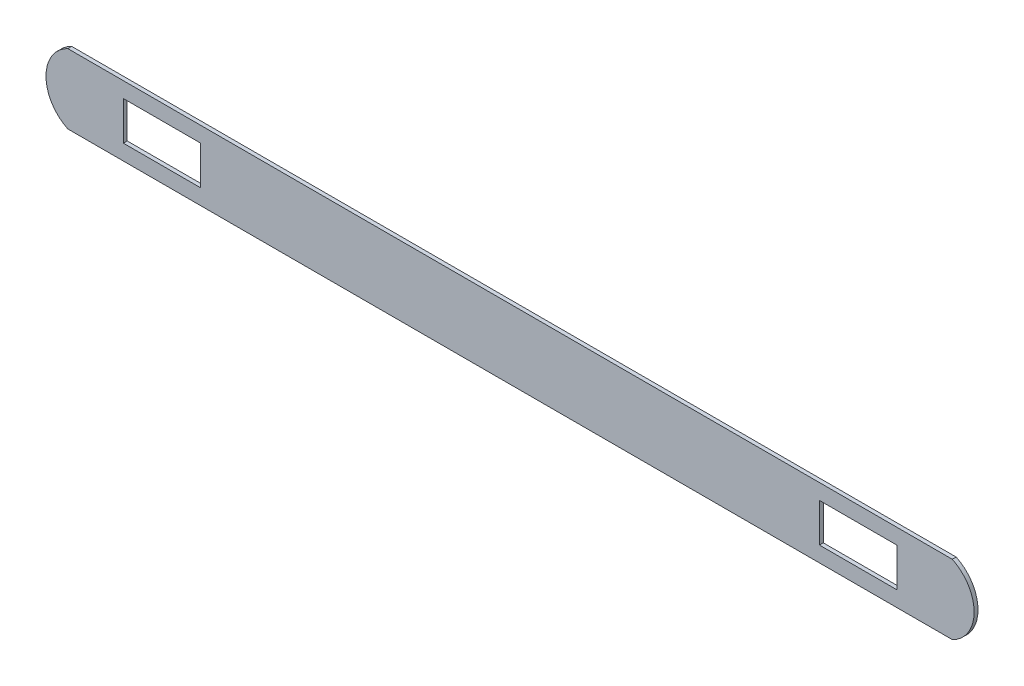
ISO-10303-21;
HEADER;
FILE_DESCRIPTION(('STEP AP214'),'2;1');
FILE_NAME('part.step','',(''),(''),'','','');
FILE_SCHEMA(('AUTOMOTIVE_DESIGN { 1 0 10303 214 1 1 1 1 }'));
ENDSEC;
DATA;
#1=APPLICATION_CONTEXT('core data for automotive mechanical design processes');
#2=APPLICATION_PROTOCOL_DEFINITION('international standard','automotive_design',2000,#1);
#3=PRODUCT_CONTEXT('',#1,'mechanical');
#4=PRODUCT('Part','Part','',(#3));
#5=PRODUCT_RELATED_PRODUCT_CATEGORY('part','',(#4));
#6=PRODUCT_DEFINITION_FORMATION('','',#4);
#7=PRODUCT_DEFINITION_CONTEXT('part definition',#1,'design');
#8=PRODUCT_DEFINITION('design','',#6,#7);
#9=PRODUCT_DEFINITION_SHAPE('','',#8);
#10=(LENGTH_UNIT() NAMED_UNIT(*) SI_UNIT(.MILLI.,.METRE.));
#11=(NAMED_UNIT(*) PLANE_ANGLE_UNIT() SI_UNIT($,.RADIAN.));
#12=(NAMED_UNIT(*) SI_UNIT($,.STERADIAN.) SOLID_ANGLE_UNIT());
#13=UNCERTAINTY_MEASURE_WITH_UNIT(LENGTH_MEASURE(1.E-05),#10,'distance_accuracy_value','');
#14=(GEOMETRIC_REPRESENTATION_CONTEXT(3) GLOBAL_UNCERTAINTY_ASSIGNED_CONTEXT((#13)) GLOBAL_UNIT_ASSIGNED_CONTEXT((#10,
#11,#12)) REPRESENTATION_CONTEXT('',''));
#15=CARTESIAN_POINT('',(0.,0.,0.));
#16=DIRECTION('',(0.,0.,1.));
#17=DIRECTION('',(1.,0.,0.));
#18=AXIS2_PLACEMENT_3D('',#15,#16,#17);
#19=CARTESIAN_POINT('',(0.,45.,0.));
#20=DIRECTION('',(0.,-1.,0.));
#21=DIRECTION('',(0.,0.,-1.));
#22=AXIS2_PLACEMENT_3D('',#19,#20,#21);
#23=PLANE('',#22);
#24=DIRECTION('',(0.,0.,-1.));
#25=VECTOR('',#24,1.);
#26=CARTESIAN_POINT('',(-524.528236675635,45.,80.));
#27=LINE('',#26,#25);
#28=CARTESIAN_POINT('',(-524.528236675635,45.,5.));
#29=VERTEX_POINT('',#28);
#30=CARTESIAN_POINT('',(-524.528236675635,45.,0.));
#31=VERTEX_POINT('',#30);
#32=EDGE_CURVE('E219',#29,#31,#27,.T.);
#33=ORIENTED_EDGE('',*,*,#32,.F.);
#34=DIRECTION('',(1.,0.,0.));
#35=VECTOR('',#34,1.);
#36=CARTESIAN_POINT('',(597.266258042068,45.,5.));
#37=LINE('',#36,#35);
#38=CARTESIAN_POINT('',(619.060752759772,45.,5.));
#39=VERTEX_POINT('',#38);
#40=EDGE_CURVE('E11',#29,#39,#37,.T.);
#41=ORIENTED_EDGE('',*,*,#40,.T.);
#42=DIRECTION('',(0.,0.,-1.));
#43=VECTOR('',#42,1.);
#44=CARTESIAN_POINT('',(619.060752759772,45.,80.));
#45=LINE('',#44,#43);
#46=CARTESIAN_POINT('',(619.060752759772,45.,0.));
#47=VERTEX_POINT('',#46);
#48=EDGE_CURVE('E49',#47,#39,#45,.F.);
#49=ORIENTED_EDGE('',*,*,#48,.F.);
#50=DIRECTION('',(1.,0.,0.));
#51=VECTOR('',#50,1.);
#52=CARTESIAN_POINT('',(-502.733741957931,45.,0.));
#53=LINE('',#52,#51);
#54=EDGE_CURVE('E37',#31,#47,#53,.T.);
#55=ORIENTED_EDGE('',*,*,#54,.F.);
#56=EDGE_LOOP('',(#33,#41,#49,#55));
#57=FACE_BOUND('',#56,.T.);
#58=ADVANCED_FACE('F34',(#57),#23,.F.);
#59=CARTESIAN_POINT('',(0.,-45.,0.));
#60=DIRECTION('',(0.,1.,0.));
#61=DIRECTION('',(0.,0.,1.));
#62=AXIS2_PLACEMENT_3D('',#59,#60,#61);
#63=PLANE('',#62);
#64=DIRECTION('',(0.,0.,-1.));
#65=VECTOR('',#64,1.);
#66=CARTESIAN_POINT('',(619.060752759772,-45.,80.));
#67=LINE('',#66,#65);
#68=CARTESIAN_POINT('',(619.060752759772,-45.,5.));
#69=VERTEX_POINT('',#68);
#70=CARTESIAN_POINT('',(619.060752759772,-45.,0.));
#71=VERTEX_POINT('',#70);
#72=EDGE_CURVE('E207',#69,#71,#67,.T.);
#73=ORIENTED_EDGE('',*,*,#72,.F.);
#74=DIRECTION('',(-1.,0.,0.));
#75=VECTOR('',#74,1.);
#76=CARTESIAN_POINT('',(597.266258042068,-45.,5.));
#77=LINE('',#76,#75);
#78=CARTESIAN_POINT('',(-524.528236675635,-45.,5.));
#79=VERTEX_POINT('',#78);
#80=EDGE_CURVE('E208',#69,#79,#77,.T.);
#81=ORIENTED_EDGE('',*,*,#80,.T.);
#82=DIRECTION('',(0.,0.,-1.));
#83=VECTOR('',#82,1.);
#84=CARTESIAN_POINT('',(-524.528236675635,-45.,80.));
#85=LINE('',#84,#83);
#86=CARTESIAN_POINT('',(-524.528236675635,-45.,0.));
#87=VERTEX_POINT('',#86);
#88=EDGE_CURVE('E214',#87,#79,#85,.F.);
#89=ORIENTED_EDGE('',*,*,#88,.F.);
#90=DIRECTION('',(-1.,0.,0.));
#91=VECTOR('',#90,1.);
#92=CARTESIAN_POINT('',(-502.733741957931,-45.,0.));
#93=LINE('',#92,#91);
#94=EDGE_CURVE('E211',#71,#87,#93,.T.);
#95=ORIENTED_EDGE('',*,*,#94,.F.);
#96=EDGE_LOOP('',(#73,#81,#89,#95));
#97=FACE_BOUND('',#96,.T.);
#98=ADVANCED_FACE('F231',(#97),#63,.F.);
#99=CARTESIAN_POINT('',(-502.733741957931,0.,0.));
#100=DIRECTION('',(0.,0.,1.));
#101=DIRECTION('',(1.,0.,0.));
#102=AXIS2_PLACEMENT_3D('',#99,#100,#101);
#103=PLANE('',#102);
#104=DIRECTION('',(-1.,0.,0.));
#105=VECTOR('',#104,1.);
#106=CARTESIAN_POINT('',(-502.733741957931,25.,0.));
#107=LINE('',#106,#105);
#108=CARTESIAN_POINT('',(-352.733741957931,25.,0.));
#109=VERTEX_POINT('',#108);
#110=CARTESIAN_POINT('',(-452.733741957932,25.,0.));
#111=VERTEX_POINT('',#110);
#112=EDGE_CURVE('E193',#109,#111,#107,.T.);
#113=ORIENTED_EDGE('',*,*,#112,.T.);
#114=DIRECTION('',(0.,-1.,0.));
#115=VECTOR('',#114,1.);
#116=CARTESIAN_POINT('',(-452.733741957932,0.,0.));
#117=LINE('',#116,#115);
#118=CARTESIAN_POINT('',(-452.733741957932,-25.,0.));
#119=VERTEX_POINT('',#118);
#120=EDGE_CURVE('E196',#111,#119,#117,.T.);
#121=ORIENTED_EDGE('',*,*,#120,.T.);
#122=DIRECTION('',(1.,0.,0.));
#123=VECTOR('',#122,1.);
#124=CARTESIAN_POINT('',(-502.733741957931,-25.,0.));
#125=LINE('',#124,#123);
#126=CARTESIAN_POINT('',(-352.733741957931,-25.,0.));
#127=VERTEX_POINT('',#126);
#128=EDGE_CURVE('E190',#119,#127,#125,.T.);
#129=ORIENTED_EDGE('',*,*,#128,.T.);
#130=DIRECTION('',(0.,1.,0.));
#131=VECTOR('',#130,1.);
#132=CARTESIAN_POINT('',(-352.733741957931,0.,0.));
#133=LINE('',#132,#131);
#134=EDGE_CURVE('E131',#127,#109,#133,.T.);
#135=ORIENTED_EDGE('',*,*,#134,.T.);
#136=EDGE_LOOP('',(#113,#121,#129,#135));
#137=FACE_BOUND('',#136,.T.);
#138=DIRECTION('',(-1.,0.,0.));
#139=VECTOR('',#138,1.);
#140=CARTESIAN_POINT('',(-502.733741957931,25.0000000000004,0.));
#141=LINE('',#140,#139);
#142=CARTESIAN_POINT('',(547.266258042068,25.,0.));
#143=VERTEX_POINT('',#142);
#144=CARTESIAN_POINT('',(447.266258042068,25.,0.));
#145=VERTEX_POINT('',#144);
#146=EDGE_CURVE('E184',#143,#145,#141,.T.);
#147=ORIENTED_EDGE('',*,*,#146,.T.);
#148=DIRECTION('',(0.,-1.,0.));
#149=VECTOR('',#148,1.);
#150=CARTESIAN_POINT('',(447.266258042068,0.,0.));
#151=LINE('',#150,#149);
#152=CARTESIAN_POINT('',(447.266258042068,-25.,0.));
#153=VERTEX_POINT('',#152);
#154=EDGE_CURVE('E187',#145,#153,#151,.T.);
#155=ORIENTED_EDGE('',*,*,#154,.T.);
#156=DIRECTION('',(1.,0.,0.));
#157=VECTOR('',#156,1.);
#158=CARTESIAN_POINT('',(-502.733741957931,-25.,0.));
#159=LINE('',#158,#157);
#160=CARTESIAN_POINT('',(547.266258042068,-25.,0.));
#161=VERTEX_POINT('',#160);
#162=EDGE_CURVE('E156',#153,#161,#159,.T.);
#163=ORIENTED_EDGE('',*,*,#162,.T.);
#164=DIRECTION('',(0.,1.,0.));
#165=VECTOR('',#164,1.);
#166=CARTESIAN_POINT('',(547.266258042068,0.,0.));
#167=LINE('',#166,#165);
#168=EDGE_CURVE('E181',#161,#143,#167,.T.);
#169=ORIENTED_EDGE('',*,*,#168,.T.);
#170=EDGE_LOOP('',(#147,#155,#163,#169));
#171=FACE_BOUND('',#170,.T.);
#172=CARTESIAN_POINT('',(-502.733741957931,0.,0.));
#173=DIRECTION('',(0.,0.,1.));
#174=DIRECTION('',(1.,0.,0.));
#175=AXIS2_PLACEMENT_3D('',#172,#173,#174);
#176=CIRCLE('',#175,50.);
#177=EDGE_CURVE('E203',#31,#87,#176,.T.);
#178=ORIENTED_EDGE('',*,*,#177,.F.);
#179=ORIENTED_EDGE('',*,*,#54,.T.);
#180=CARTESIAN_POINT('',(597.266258042068,0.,0.));
#181=DIRECTION('',(0.,0.,1.));
#182=DIRECTION('',(1.,0.,0.));
#183=AXIS2_PLACEMENT_3D('',#180,#181,#182);
#184=CIRCLE('',#183,50.);
#185=EDGE_CURVE('E199',#71,#47,#184,.T.);
#186=ORIENTED_EDGE('',*,*,#185,.F.);
#187=ORIENTED_EDGE('',*,*,#94,.T.);
#188=EDGE_LOOP('',(#178,#179,#186,#187));
#189=FACE_BOUND('',#188,.T.);
#190=ADVANCED_FACE('F226',(#137,#171,#189),#103,.F.);
#191=CARTESIAN_POINT('',(-502.733741957931,0.,80.));
#192=DIRECTION('',(0.,0.,-1.));
#193=DIRECTION('',(-1.,0.,0.));
#194=AXIS2_PLACEMENT_3D('',#191,#192,#193);
#195=CYLINDRICAL_SURFACE('',#194,50.);
#196=CARTESIAN_POINT('',(-502.733741957931,0.,5.));
#197=DIRECTION('',(0.,0.,1.));
#198=DIRECTION('',(1.,0.,0.));
#199=AXIS2_PLACEMENT_3D('',#196,#197,#198);
#200=CIRCLE('',#199,50.);
#201=EDGE_CURVE('E205',#29,#79,#200,.T.);
#202=ORIENTED_EDGE('',*,*,#201,.F.);
#203=ORIENTED_EDGE('',*,*,#32,.T.);
#204=ORIENTED_EDGE('',*,*,#177,.T.);
#205=ORIENTED_EDGE('',*,*,#88,.T.);
#206=EDGE_LOOP('',(#202,#203,#204,#205));
#207=FACE_BOUND('',#206,.T.);
#208=ADVANCED_FACE('F233',(#207),#195,.T.);
#209=CARTESIAN_POINT('',(597.266258042068,0.,80.));
#210=DIRECTION('',(0.,0.,-1.));
#211=DIRECTION('',(-1.,0.,0.));
#212=AXIS2_PLACEMENT_3D('',#209,#210,#211);
#213=CYLINDRICAL_SURFACE('',#212,50.);
#214=ORIENTED_EDGE('',*,*,#185,.T.);
#215=ORIENTED_EDGE('',*,*,#48,.T.);
#216=CARTESIAN_POINT('',(597.266258042068,0.,5.));
#217=DIRECTION('',(0.,0.,1.));
#218=DIRECTION('',(1.,0.,0.));
#219=AXIS2_PLACEMENT_3D('',#216,#217,#218);
#220=CIRCLE('',#219,50.);
#221=EDGE_CURVE('E201',#69,#39,#220,.T.);
#222=ORIENTED_EDGE('',*,*,#221,.F.);
#223=ORIENTED_EDGE('',*,*,#72,.T.);
#224=EDGE_LOOP('',(#214,#215,#222,#223));
#225=FACE_BOUND('',#224,.T.);
#226=ADVANCED_FACE('F228',(#225),#213,.T.);
#227=CARTESIAN_POINT('',(597.266258042068,-45.,5.));
#228=DIRECTION('',(0.,0.,1.));
#229=DIRECTION('',(1.,0.,0.));
#230=AXIS2_PLACEMENT_3D('',#227,#228,#229);
#231=PLANE('',#230);
#232=ORIENTED_EDGE('',*,*,#40,.F.);
#233=ORIENTED_EDGE('',*,*,#201,.T.);
#234=ORIENTED_EDGE('',*,*,#80,.F.);
#235=ORIENTED_EDGE('',*,*,#221,.T.);
#236=EDGE_LOOP('',(#232,#233,#234,#235));
#237=FACE_BOUND('',#236,.T.);
#238=DIRECTION('',(0.,-1.,0.));
#239=VECTOR('',#238,1.);
#240=CARTESIAN_POINT('',(-452.733741957932,25.,5.));
#241=LINE('',#240,#239);
#242=CARTESIAN_POINT('',(-452.733741957932,25.,5.));
#243=VERTEX_POINT('',#242);
#244=CARTESIAN_POINT('',(-452.733741957931,-25.,5.));
#245=VERTEX_POINT('',#244);
#246=EDGE_CURVE('E144',#243,#245,#241,.T.);
#247=ORIENTED_EDGE('',*,*,#246,.F.);
#248=DIRECTION('',(-1.,0.,0.));
#249=VECTOR('',#248,1.);
#250=CARTESIAN_POINT('',(-452.733741957932,25.,5.));
#251=LINE('',#250,#249);
#252=CARTESIAN_POINT('',(-352.733741957931,25.,5.));
#253=VERTEX_POINT('',#252);
#254=EDGE_CURVE('E149',#253,#243,#251,.T.);
#255=ORIENTED_EDGE('',*,*,#254,.F.);
#256=DIRECTION('',(0.,1.,0.));
#257=VECTOR('',#256,1.);
#258=CARTESIAN_POINT('',(-352.733741957931,25.,5.));
#259=LINE('',#258,#257);
#260=CARTESIAN_POINT('',(-352.733741957931,-25.,5.));
#261=VERTEX_POINT('',#260);
#262=EDGE_CURVE('E128',#261,#253,#259,.T.);
#263=ORIENTED_EDGE('',*,*,#262,.F.);
#264=DIRECTION('',(1.,0.,0.));
#265=VECTOR('',#264,1.);
#266=CARTESIAN_POINT('',(-452.733741957932,-25.,5.));
#267=LINE('',#266,#265);
#268=EDGE_CURVE('E139',#245,#261,#267,.T.);
#269=ORIENTED_EDGE('',*,*,#268,.F.);
#270=EDGE_LOOP('',(#247,#255,#263,#269));
#271=FACE_BOUND('',#270,.T.);
#272=DIRECTION('',(0.,-1.,0.));
#273=VECTOR('',#272,1.);
#274=CARTESIAN_POINT('',(447.266258042068,25.,5.));
#275=LINE('',#274,#273);
#276=CARTESIAN_POINT('',(447.266258042068,25.,5.));
#277=VERTEX_POINT('',#276);
#278=CARTESIAN_POINT('',(447.266258042068,-25.,5.));
#279=VERTEX_POINT('',#278);
#280=EDGE_CURVE('E159',#277,#279,#275,.T.);
#281=ORIENTED_EDGE('',*,*,#280,.F.);
#282=DIRECTION('',(-1.,0.,0.));
#283=VECTOR('',#282,1.);
#284=CARTESIAN_POINT('',(447.266258042068,25.,5.));
#285=LINE('',#284,#283);
#286=CARTESIAN_POINT('',(547.266258042068,25.,5.));
#287=VERTEX_POINT('',#286);
#288=EDGE_CURVE('E167',#287,#277,#285,.T.);
#289=ORIENTED_EDGE('',*,*,#288,.F.);
#290=DIRECTION('',(0.,1.,0.));
#291=VECTOR('',#290,1.);
#292=CARTESIAN_POINT('',(547.266258042068,25.,5.));
#293=LINE('',#292,#291);
#294=CARTESIAN_POINT('',(547.266258042068,-25.,5.));
#295=VERTEX_POINT('',#294);
#296=EDGE_CURVE('E164',#295,#287,#293,.T.);
#297=ORIENTED_EDGE('',*,*,#296,.F.);
#298=DIRECTION('',(1.,0.,0.));
#299=VECTOR('',#298,1.);
#300=CARTESIAN_POINT('',(447.266258042068,-25.,5.));
#301=LINE('',#300,#299);
#302=EDGE_CURVE('E161',#279,#295,#301,.T.);
#303=ORIENTED_EDGE('',*,*,#302,.F.);
#304=EDGE_LOOP('',(#281,#289,#297,#303));
#305=FACE_BOUND('',#304,.T.);
#306=ADVANCED_FACE('F146',(#237,#271,#305),#231,.T.);
#307=CARTESIAN_POINT('',(447.266258042068,25.,-5.));
#308=DIRECTION('',(-1.,0.,0.));
#309=DIRECTION('',(0.,0.,1.));
#310=AXIS2_PLACEMENT_3D('',#307,#308,#309);
#311=PLANE('',#310);
#312=DIRECTION('',(0.,0.,1.));
#313=VECTOR('',#312,1.);
#314=CARTESIAN_POINT('',(447.266258042068,25.,-5.));
#315=LINE('',#314,#313);
#316=EDGE_CURVE('E171',#145,#277,#315,.T.);
#317=ORIENTED_EDGE('',*,*,#316,.T.);
#318=ORIENTED_EDGE('',*,*,#280,.T.);
#319=DIRECTION('',(0.,0.,1.));
#320=VECTOR('',#319,1.);
#321=CARTESIAN_POINT('',(447.266258042068,-25.,-5.));
#322=LINE('',#321,#320);
#323=EDGE_CURVE('E170',#153,#279,#322,.T.);
#324=ORIENTED_EDGE('',*,*,#323,.F.);
#325=ORIENTED_EDGE('',*,*,#154,.F.);
#326=EDGE_LOOP('',(#317,#318,#324,#325));
#327=FACE_BOUND('',#326,.T.);
#328=ADVANCED_FACE('F235',(#327),#311,.F.);
#329=CARTESIAN_POINT('',(447.266258042068,25.,-5.));
#330=DIRECTION('',(0.,1.,0.));
#331=DIRECTION('',(-1.,0.,0.));
#332=AXIS2_PLACEMENT_3D('',#329,#330,#331);
#333=PLANE('',#332);
#334=DIRECTION('',(0.,0.,1.));
#335=VECTOR('',#334,1.);
#336=CARTESIAN_POINT('',(547.266258042068,25.,-5.));
#337=LINE('',#336,#335);
#338=EDGE_CURVE('E173',#143,#287,#337,.T.);
#339=ORIENTED_EDGE('',*,*,#338,.T.);
#340=ORIENTED_EDGE('',*,*,#288,.T.);
#341=ORIENTED_EDGE('',*,*,#316,.F.);
#342=ORIENTED_EDGE('',*,*,#146,.F.);
#343=EDGE_LOOP('',(#339,#340,#341,#342));
#344=FACE_BOUND('',#343,.T.);
#345=ADVANCED_FACE('F241',(#344),#333,.F.);
#346=CARTESIAN_POINT('',(547.266258042068,25.,-5.));
#347=DIRECTION('',(1.,0.,0.));
#348=DIRECTION('',(0.,0.,-1.));
#349=AXIS2_PLACEMENT_3D('',#346,#347,#348);
#350=PLANE('',#349);
#351=DIRECTION('',(0.,0.,1.));
#352=VECTOR('',#351,1.);
#353=CARTESIAN_POINT('',(547.266258042068,-25.,-5.));
#354=LINE('',#353,#352);
#355=EDGE_CURVE('E175',#161,#295,#354,.T.);
#356=ORIENTED_EDGE('',*,*,#355,.T.);
#357=ORIENTED_EDGE('',*,*,#296,.T.);
#358=ORIENTED_EDGE('',*,*,#338,.F.);
#359=ORIENTED_EDGE('',*,*,#168,.F.);
#360=EDGE_LOOP('',(#356,#357,#358,#359));
#361=FACE_BOUND('',#360,.T.);
#362=ADVANCED_FACE('F263',(#361),#350,.F.);
#363=CARTESIAN_POINT('',(447.266258042068,-25.,-5.));
#364=DIRECTION('',(0.,-1.,0.));
#365=DIRECTION('',(0.,0.,-1.));
#366=AXIS2_PLACEMENT_3D('',#363,#364,#365);
#367=PLANE('',#366);
#368=ORIENTED_EDGE('',*,*,#323,.T.);
#369=ORIENTED_EDGE('',*,*,#302,.T.);
#370=ORIENTED_EDGE('',*,*,#355,.F.);
#371=ORIENTED_EDGE('',*,*,#162,.F.);
#372=EDGE_LOOP('',(#368,#369,#370,#371));
#373=FACE_BOUND('',#372,.T.);
#374=ADVANCED_FACE('F259',(#373),#367,.F.);
#375=CARTESIAN_POINT('',(-452.733741957932,25.,-5.));
#376=DIRECTION('',(-1.,0.,0.));
#377=DIRECTION('',(0.,0.,1.));
#378=AXIS2_PLACEMENT_3D('',#375,#376,#377);
#379=PLANE('',#378);
#380=DIRECTION('',(0.,0.,1.));
#381=VECTOR('',#380,1.);
#382=CARTESIAN_POINT('',(-452.733741957932,25.,-5.));
#383=LINE('',#382,#381);
#384=EDGE_CURVE('E154',#111,#243,#383,.T.);
#385=ORIENTED_EDGE('',*,*,#384,.T.);
#386=ORIENTED_EDGE('',*,*,#246,.T.);
#387=DIRECTION('',(0.,0.,1.));
#388=VECTOR('',#387,1.);
#389=CARTESIAN_POINT('',(-452.733741957932,-25.,-5.));
#390=LINE('',#389,#388);
#391=EDGE_CURVE('E135',#119,#245,#390,.T.);
#392=ORIENTED_EDGE('',*,*,#391,.F.);
#393=ORIENTED_EDGE('',*,*,#120,.F.);
#394=EDGE_LOOP('',(#385,#386,#392,#393));
#395=FACE_BOUND('',#394,.T.);
#396=ADVANCED_FACE('F262',(#395),#379,.F.);
#397=CARTESIAN_POINT('',(-452.733741957932,25.,-5.));
#398=DIRECTION('',(0.,1.,0.));
#399=DIRECTION('',(0.,0.,1.));
#400=AXIS2_PLACEMENT_3D('',#397,#398,#399);
#401=PLANE('',#400);
#402=DIRECTION('',(0.,0.,1.));
#403=VECTOR('',#402,1.);
#404=CARTESIAN_POINT('',(-352.733741957931,25.,-5.));
#405=LINE('',#404,#403);
#406=EDGE_CURVE('E134',#109,#253,#405,.T.);
#407=ORIENTED_EDGE('',*,*,#406,.T.);
#408=ORIENTED_EDGE('',*,*,#254,.T.);
#409=ORIENTED_EDGE('',*,*,#384,.F.);
#410=ORIENTED_EDGE('',*,*,#112,.F.);
#411=EDGE_LOOP('',(#407,#408,#409,#410));
#412=FACE_BOUND('',#411,.T.);
#413=ADVANCED_FACE('F273',(#412),#401,.F.);
#414=CARTESIAN_POINT('',(-352.733741957931,25.,-5.));
#415=DIRECTION('',(1.,0.,0.));
#416=DIRECTION('',(0.,0.,-1.));
#417=AXIS2_PLACEMENT_3D('',#414,#415,#416);
#418=PLANE('',#417);
#419=DIRECTION('',(0.,0.,1.));
#420=VECTOR('',#419,1.);
#421=CARTESIAN_POINT('',(-352.733741957931,-25.,-5.));
#422=LINE('',#421,#420);
#423=EDGE_CURVE('E123',#127,#261,#422,.T.);
#424=ORIENTED_EDGE('',*,*,#423,.T.);
#425=ORIENTED_EDGE('',*,*,#262,.T.);
#426=ORIENTED_EDGE('',*,*,#406,.F.);
#427=ORIENTED_EDGE('',*,*,#134,.F.);
#428=EDGE_LOOP('',(#424,#425,#426,#427));
#429=FACE_BOUND('',#428,.T.);
#430=ADVANCED_FACE('F125',(#429),#418,.F.);
#431=CARTESIAN_POINT('',(-452.733741957932,-25.,-5.));
#432=DIRECTION('',(0.,-1.,0.));
#433=DIRECTION('',(0.,0.,-1.));
#434=AXIS2_PLACEMENT_3D('',#431,#432,#433);
#435=PLANE('',#434);
#436=ORIENTED_EDGE('',*,*,#391,.T.);
#437=ORIENTED_EDGE('',*,*,#268,.T.);
#438=ORIENTED_EDGE('',*,*,#423,.F.);
#439=ORIENTED_EDGE('',*,*,#128,.F.);
#440=EDGE_LOOP('',(#436,#437,#438,#439));
#441=FACE_BOUND('',#440,.T.);
#442=ADVANCED_FACE('F140',(#441),#435,.F.);
#443=CLOSED_SHELL('',(#58,#98,#190,#208,#226,#306,#328,#345,#362,#374,#396,#413,#430,#442));
#444=MANIFOLD_SOLID_BREP('B2',#443);
#445=ADVANCED_BREP_SHAPE_REPRESENTATION('',(#18,#444),#14);
#446=SHAPE_DEFINITION_REPRESENTATION(#9,#445);
ENDSEC;
END-ISO-10303-21;
